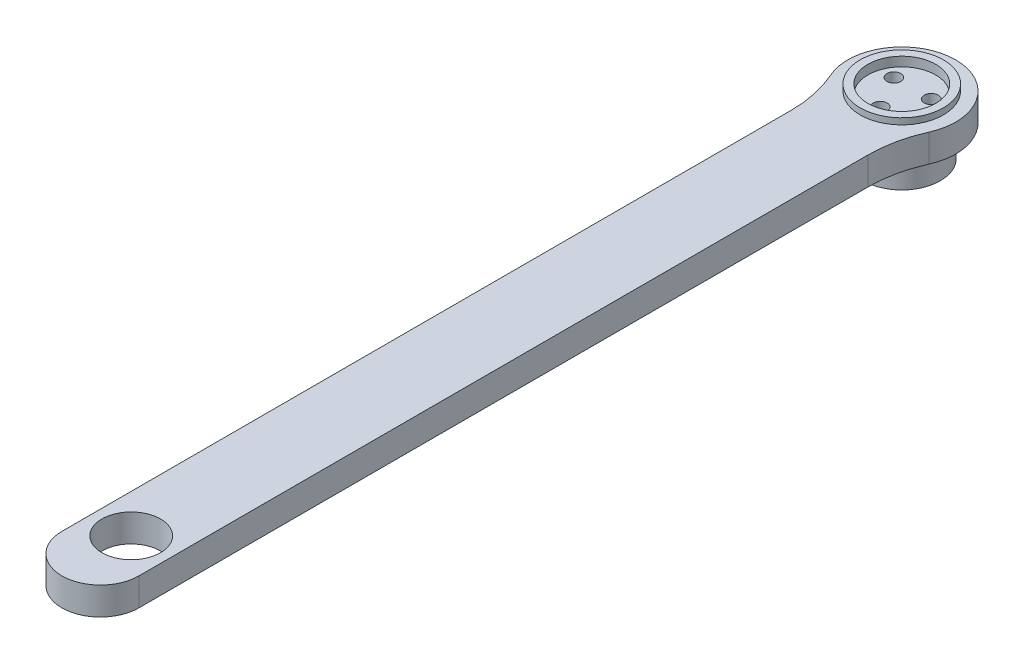
ISO-10303-21;
HEADER;
FILE_DESCRIPTION(('STEP AP214'),'2;1');
FILE_NAME('part.step','',(''),(''),'','','');
FILE_SCHEMA(('AUTOMOTIVE_DESIGN { 1 0 10303 214 1 1 1 1 }'));
ENDSEC;
DATA;
#1=APPLICATION_CONTEXT('core data for automotive mechanical design processes');
#2=APPLICATION_PROTOCOL_DEFINITION('international standard','automotive_design',2000,#1);
#3=PRODUCT_CONTEXT('',#1,'mechanical');
#4=PRODUCT('Part','Part','',(#3));
#5=PRODUCT_RELATED_PRODUCT_CATEGORY('part','',(#4));
#6=PRODUCT_DEFINITION_FORMATION('','',#4);
#7=PRODUCT_DEFINITION_CONTEXT('part definition',#1,'design');
#8=PRODUCT_DEFINITION('design','',#6,#7);
#9=PRODUCT_DEFINITION_SHAPE('','',#8);
#10=(LENGTH_UNIT() NAMED_UNIT(*) SI_UNIT(.MILLI.,.METRE.));
#11=(NAMED_UNIT(*) PLANE_ANGLE_UNIT() SI_UNIT($,.RADIAN.));
#12=(NAMED_UNIT(*) SI_UNIT($,.STERADIAN.) SOLID_ANGLE_UNIT());
#13=UNCERTAINTY_MEASURE_WITH_UNIT(LENGTH_MEASURE(1.E-05),#10,'distance_accuracy_value','');
#14=(GEOMETRIC_REPRESENTATION_CONTEXT(3) GLOBAL_UNCERTAINTY_ASSIGNED_CONTEXT((#13)) GLOBAL_UNIT_ASSIGNED_CONTEXT((#10,
#11,#12)) REPRESENTATION_CONTEXT('',''));
#15=CARTESIAN_POINT('',(0.,0.,0.));
#16=DIRECTION('',(0.,0.,1.));
#17=DIRECTION('',(1.,0.,0.));
#18=AXIS2_PLACEMENT_3D('',#15,#16,#17);
#19=CARTESIAN_POINT('',(0.,-3.,7.));
#20=DIRECTION('',(0.,-1.,0.));
#21=DIRECTION('',(0.,0.,-1.));
#22=AXIS2_PLACEMENT_3D('',#19,#20,#21);
#23=CYLINDRICAL_SURFACE('',#22,2.25);
#24=CARTESIAN_POINT('',(0.,1.4,7.));
#25=DIRECTION('',(0.,-1.,0.));
#26=DIRECTION('',(0.,0.,-1.));
#27=AXIS2_PLACEMENT_3D('',#24,#25,#26);
#28=CIRCLE('',#27,2.25000000000001);
#29=CARTESIAN_POINT('',(0.,1.4,4.74999999999999));
#30=VERTEX_POINT('',#29);
#31=EDGE_CURVE('E468',#30,#30,#28,.T.);
#32=ORIENTED_EDGE('',*,*,#31,.T.);
#33=EDGE_LOOP('',(#32));
#34=FACE_BOUND('',#33,.T.);
#35=CARTESIAN_POINT('',(0.,8.,7.));
#36=DIRECTION('',(0.,1.,0.));
#37=DIRECTION('',(0.,0.,1.));
#38=AXIS2_PLACEMENT_3D('',#35,#36,#37);
#39=CIRCLE('',#38,2.25);
#40=CARTESIAN_POINT('',(0.,8.,9.25000000000001));
#41=VERTEX_POINT('',#40);
#42=EDGE_CURVE('E435',#41,#41,#39,.F.);
#43=ORIENTED_EDGE('',*,*,#42,.F.);
#44=EDGE_LOOP('',(#43));
#45=FACE_BOUND('',#44,.T.);
#46=ADVANCED_FACE('F38',(#34,#45),#23,.F.);
#47=CARTESIAN_POINT('',(-6.06217782649106,-3.,-3.50000000000003));
#48=DIRECTION('',(0.,-1.,0.));
#49=DIRECTION('',(0.,0.,-1.));
#50=AXIS2_PLACEMENT_3D('',#47,#48,#49);
#51=CYLINDRICAL_SURFACE('',#50,2.25);
#52=CARTESIAN_POINT('',(-6.06217782649106,1.4,-3.50000000000003));
#53=DIRECTION('',(0.,-1.,0.));
#54=DIRECTION('',(0.,0.,-1.));
#55=AXIS2_PLACEMENT_3D('',#52,#53,#54);
#56=CIRCLE('',#55,2.25000000000001);
#57=CARTESIAN_POINT('',(-6.06217782649106,1.4,-5.75000000000004));
#58=VERTEX_POINT('',#57);
#59=EDGE_CURVE('E462',#58,#58,#56,.T.);
#60=ORIENTED_EDGE('',*,*,#59,.T.);
#61=EDGE_LOOP('',(#60));
#62=FACE_BOUND('',#61,.T.);
#63=CARTESIAN_POINT('',(-6.06217782649106,8.,-3.50000000000003));
#64=DIRECTION('',(0.,1.,0.));
#65=DIRECTION('',(0.,0.,1.));
#66=AXIS2_PLACEMENT_3D('',#63,#64,#65);
#67=CIRCLE('',#66,2.25);
#68=CARTESIAN_POINT('',(-6.06217782649106,8.,-1.25000000000002));
#69=VERTEX_POINT('',#68);
#70=EDGE_CURVE('E134',#69,#69,#67,.F.);
#71=ORIENTED_EDGE('',*,*,#70,.F.);
#72=EDGE_LOOP('',(#71));
#73=FACE_BOUND('',#72,.T.);
#74=ADVANCED_FACE('F164',(#62,#73),#51,.F.);
#75=CARTESIAN_POINT('',(6.0621778264911,-3.,-3.49999999999994));
#76=DIRECTION('',(0.,-1.,0.));
#77=DIRECTION('',(0.,0.,-1.));
#78=AXIS2_PLACEMENT_3D('',#75,#76,#77);
#79=CYLINDRICAL_SURFACE('',#78,2.25);
#80=CARTESIAN_POINT('',(6.0621778264911,1.4,-3.49999999999994));
#81=DIRECTION('',(0.,-1.,0.));
#82=DIRECTION('',(0.,0.,-1.));
#83=AXIS2_PLACEMENT_3D('',#80,#81,#82);
#84=CIRCLE('',#83,2.25000000000001);
#85=CARTESIAN_POINT('',(6.0621778264911,1.4,-5.74999999999996));
#86=VERTEX_POINT('',#85);
#87=EDGE_CURVE('E426',#86,#86,#84,.T.);
#88=ORIENTED_EDGE('',*,*,#87,.T.);
#89=EDGE_LOOP('',(#88));
#90=FACE_BOUND('',#89,.T.);
#91=CARTESIAN_POINT('',(6.0621778264911,8.,-3.49999999999994));
#92=DIRECTION('',(0.,1.,0.));
#93=DIRECTION('',(0.,0.,1.));
#94=AXIS2_PLACEMENT_3D('',#91,#92,#93);
#95=CIRCLE('',#94,2.25);
#96=CARTESIAN_POINT('',(6.0621778264911,8.,-1.24999999999994));
#97=VERTEX_POINT('',#96);
#98=EDGE_CURVE('E131',#97,#97,#95,.F.);
#99=ORIENTED_EDGE('',*,*,#98,.F.);
#100=EDGE_LOOP('',(#99));
#101=FACE_BOUND('',#100,.T.);
#102=ADVANCED_FACE('F170',(#90,#101),#79,.F.);
#103=CARTESIAN_POINT('',(0.,11.,0.));
#104=DIRECTION('',(0.,1.,0.));
#105=DIRECTION('',(0.,0.,1.));
#106=AXIS2_PLACEMENT_3D('',#103,#104,#105);
#107=PLANE('',#106);
#108=CARTESIAN_POINT('',(0.,11.,0.));
#109=DIRECTION('',(0.,1.,0.));
#110=DIRECTION('',(0.,0.,1.));
#111=AXIS2_PLACEMENT_3D('',#108,#109,#110);
#112=CIRCLE('',#111,11.);
#113=CARTESIAN_POINT('',(0.,11.,11.));
#114=VERTEX_POINT('',#113);
#115=EDGE_CURVE('E516',#114,#114,#112,.T.);
#116=ORIENTED_EDGE('',*,*,#115,.F.);
#117=EDGE_LOOP('',(#116));
#118=FACE_BOUND('',#117,.T.);
#119=CARTESIAN_POINT('',(0.,11.,0.));
#120=DIRECTION('',(0.,1.,0.));
#121=DIRECTION('',(0.,0.,1.));
#122=AXIS2_PLACEMENT_3D('',#119,#120,#121);
#123=CIRCLE('',#122,13.5);
#124=CARTESIAN_POINT('',(0.,11.,13.5));
#125=VERTEX_POINT('',#124);
#126=EDGE_CURVE('E118',#125,#125,#123,.T.);
#127=ORIENTED_EDGE('',*,*,#126,.T.);
#128=EDGE_LOOP('',(#127));
#129=FACE_BOUND('',#128,.T.);
#130=ADVANCED_FACE('F192',(#118,#129),#107,.T.);
#131=CARTESIAN_POINT('',(0.,9.,0.));
#132=DIRECTION('',(0.,-1.,0.));
#133=DIRECTION('',(0.,0.,-1.));
#134=AXIS2_PLACEMENT_3D('',#131,#132,#133);
#135=CYLINDRICAL_SURFACE('',#134,17.5);
#136=CARTESIAN_POINT('',(0.,9.,0.));
#137=DIRECTION('',(0.,1.,0.));
#138=DIRECTION('',(0.,0.,1.));
#139=AXIS2_PLACEMENT_3D('',#136,#137,#138);
#140=CIRCLE('',#139,17.5);
#141=CARTESIAN_POINT('',(15.9782608695652,9.,7.1375891997313));
#142=VERTEX_POINT('',#141);
#143=CARTESIAN_POINT('',(-15.9782608695652,9.,7.1375891997313));
#144=VERTEX_POINT('',#143);
#145=EDGE_CURVE('E95',#142,#144,#140,.T.);
#146=ORIENTED_EDGE('',*,*,#145,.F.);
#147=DIRECTION('',(0.,-1.,0.));
#148=VECTOR('',#147,1.);
#149=CARTESIAN_POINT('',(15.9782608695652,9.,7.1375891997313));
#150=LINE('',#149,#148);
#151=CARTESIAN_POINT('',(15.9782608695652,0.,7.1375891997313));
#152=VERTEX_POINT('',#151);
#153=EDGE_CURVE('E138',#142,#152,#150,.T.);
#154=ORIENTED_EDGE('',*,*,#153,.T.);
#155=CARTESIAN_POINT('',(0.,0.,0.));
#156=DIRECTION('',(0.,1.,0.));
#157=DIRECTION('',(0.,0.,1.));
#158=AXIS2_PLACEMENT_3D('',#155,#156,#157);
#159=CIRCLE('',#158,17.5);
#160=CARTESIAN_POINT('',(-15.9782608695652,0.,7.1375891997313));
#161=VERTEX_POINT('',#160);
#162=EDGE_CURVE('E115',#152,#161,#159,.T.);
#163=ORIENTED_EDGE('',*,*,#162,.T.);
#164=DIRECTION('',(0.,-1.,0.));
#165=VECTOR('',#164,1.);
#166=CARTESIAN_POINT('',(-15.9782608695652,9.,7.1375891997313));
#167=LINE('',#166,#165);
#168=EDGE_CURVE('E136',#161,#144,#167,.F.);
#169=ORIENTED_EDGE('',*,*,#168,.T.);
#170=EDGE_LOOP('',(#146,#154,#163,#169));
#171=FACE_BOUND('',#170,.T.);
#172=ADVANCED_FACE('F154',(#171),#135,.T.);
#173=CARTESIAN_POINT('',(-12.5,9.,260.));
#174=DIRECTION('',(1.,0.,0.));
#175=DIRECTION('',(0.,0.,-1.));
#176=AXIS2_PLACEMENT_3D('',#173,#174,#175);
#177=PLANE('',#176);
#178=DIRECTION('',(0.,0.,1.));
#179=VECTOR('',#178,1.);
#180=CARTESIAN_POINT('',(-12.5,9.,260.));
#181=LINE('',#180,#179);
#182=CARTESIAN_POINT('',(-12.5,9.,23.4520787991171));
#183=VERTEX_POINT('',#182);
#184=CARTESIAN_POINT('',(-12.4999999999999,9.,260.));
#185=VERTEX_POINT('',#184);
#186=EDGE_CURVE('E87',#183,#185,#181,.T.);
#187=ORIENTED_EDGE('',*,*,#186,.F.);
#188=DIRECTION('',(0.,1.,0.));
#189=VECTOR('',#188,1.);
#190=CARTESIAN_POINT('',(-12.5,0.,23.4520787991171));
#191=LINE('',#190,#189);
#192=CARTESIAN_POINT('',(-12.5,0.,23.4520787991171));
#193=VERTEX_POINT('',#192);
#194=EDGE_CURVE('E144',#183,#193,#191,.F.);
#195=ORIENTED_EDGE('',*,*,#194,.T.);
#196=DIRECTION('',(0.,0.,1.));
#197=VECTOR('',#196,1.);
#198=CARTESIAN_POINT('',(-12.5,0.,260.));
#199=LINE('',#198,#197);
#200=CARTESIAN_POINT('',(-12.4999999999999,0.,260.));
#201=VERTEX_POINT('',#200);
#202=EDGE_CURVE('E101',#193,#201,#199,.T.);
#203=ORIENTED_EDGE('',*,*,#202,.T.);
#204=DIRECTION('',(0.,-1.,0.));
#205=VECTOR('',#204,1.);
#206=CARTESIAN_POINT('',(-12.4999999999999,9.,260.));
#207=LINE('',#206,#205);
#208=EDGE_CURVE('E98',#185,#201,#207,.T.);
#209=ORIENTED_EDGE('',*,*,#208,.F.);
#210=EDGE_LOOP('',(#187,#195,#203,#209));
#211=FACE_BOUND('',#210,.T.);
#212=ADVANCED_FACE('F99',(#211),#177,.F.);
#213=CARTESIAN_POINT('',(0.,9.,260.));
#214=DIRECTION('',(0.,-1.,0.));
#215=DIRECTION('',(0.,0.,-1.));
#216=AXIS2_PLACEMENT_3D('',#213,#214,#215);
#217=CYLINDRICAL_SURFACE('',#216,12.5);
#218=CARTESIAN_POINT('',(0.,0.,260.));
#219=DIRECTION('',(0.,1.,0.));
#220=DIRECTION('',(0.,0.,1.));
#221=AXIS2_PLACEMENT_3D('',#218,#219,#220);
#222=CIRCLE('',#221,12.5);
#223=CARTESIAN_POINT('',(12.5,0.,260.));
#224=VERTEX_POINT('',#223);
#225=EDGE_CURVE('E120',#201,#224,#222,.T.);
#226=ORIENTED_EDGE('',*,*,#225,.T.);
#227=DIRECTION('',(0.,-1.,0.));
#228=VECTOR('',#227,1.);
#229=CARTESIAN_POINT('',(12.5,9.,260.));
#230=LINE('',#229,#228);
#231=CARTESIAN_POINT('',(12.5,9.,260.));
#232=VERTEX_POINT('',#231);
#233=EDGE_CURVE('E105',#232,#224,#230,.T.);
#234=ORIENTED_EDGE('',*,*,#233,.F.);
#235=CARTESIAN_POINT('',(0.,9.,260.));
#236=DIRECTION('',(0.,1.,0.));
#237=DIRECTION('',(0.,0.,1.));
#238=AXIS2_PLACEMENT_3D('',#235,#236,#237);
#239=CIRCLE('',#238,12.5);
#240=EDGE_CURVE('E92',#185,#232,#239,.T.);
#241=ORIENTED_EDGE('',*,*,#240,.F.);
#242=ORIENTED_EDGE('',*,*,#208,.T.);
#243=EDGE_LOOP('',(#226,#234,#241,#242));
#244=FACE_BOUND('',#243,.T.);
#245=ADVANCED_FACE('F107',(#244),#217,.T.);
#246=CARTESIAN_POINT('',(12.5,9.,260.));
#247=DIRECTION('',(-1.,0.,0.));
#248=DIRECTION('',(0.,0.,1.));
#249=AXIS2_PLACEMENT_3D('',#246,#247,#248);
#250=PLANE('',#249);
#251=DIRECTION('',(0.,0.,-1.));
#252=VECTOR('',#251,1.);
#253=CARTESIAN_POINT('',(12.5,0.,260.));
#254=LINE('',#253,#252);
#255=CARTESIAN_POINT('',(12.5,0.,23.4520787991171));
#256=VERTEX_POINT('',#255);
#257=EDGE_CURVE('E122',#224,#256,#254,.T.);
#258=ORIENTED_EDGE('',*,*,#257,.T.);
#259=DIRECTION('',(0.,1.,0.));
#260=VECTOR('',#259,1.);
#261=CARTESIAN_POINT('',(12.5,9.,23.4520787991171));
#262=LINE('',#261,#260);
#263=CARTESIAN_POINT('',(12.5,9.,23.4520787991171));
#264=VERTEX_POINT('',#263);
#265=EDGE_CURVE('E142',#256,#264,#262,.T.);
#266=ORIENTED_EDGE('',*,*,#265,.T.);
#267=DIRECTION('',(0.,0.,-1.));
#268=VECTOR('',#267,1.);
#269=CARTESIAN_POINT('',(12.5,9.,260.));
#270=LINE('',#269,#268);
#271=EDGE_CURVE('E110',#232,#264,#270,.T.);
#272=ORIENTED_EDGE('',*,*,#271,.F.);
#273=ORIENTED_EDGE('',*,*,#233,.T.);
#274=EDGE_LOOP('',(#258,#266,#272,#273));
#275=FACE_BOUND('',#274,.T.);
#276=ADVANCED_FACE('F201',(#275),#250,.F.);
#277=CARTESIAN_POINT('',(0.,9.,0.));
#278=DIRECTION('',(0.,1.,0.));
#279=DIRECTION('',(0.,0.,1.));
#280=AXIS2_PLACEMENT_3D('',#277,#278,#279);
#281=PLANE('',#280);
#282=CARTESIAN_POINT('',(0.,9.,250.));
#283=DIRECTION('',(0.,1.,0.));
#284=DIRECTION('',(0.,0.,1.));
#285=AXIS2_PLACEMENT_3D('',#282,#283,#284);
#286=CIRCLE('',#285,9.50000000000001);
#287=CARTESIAN_POINT('',(0.,9.,259.5));
#288=VERTEX_POINT('',#287);
#289=EDGE_CURVE('E130',#288,#288,#286,.T.);
#290=ORIENTED_EDGE('',*,*,#289,.F.);
#291=EDGE_LOOP('',(#290));
#292=FACE_BOUND('',#291,.T.);
#293=CARTESIAN_POINT('',(0.,9.,0.));
#294=DIRECTION('',(0.,1.,0.));
#295=DIRECTION('',(0.,0.,1.));
#296=AXIS2_PLACEMENT_3D('',#293,#294,#295);
#297=CIRCLE('',#296,13.5);
#298=CARTESIAN_POINT('',(0.,9.,13.5));
#299=VERTEX_POINT('',#298);
#300=EDGE_CURVE('E104',#299,#299,#297,.T.);
#301=ORIENTED_EDGE('',*,*,#300,.F.);
#302=EDGE_LOOP('',(#301));
#303=FACE_BOUND('',#302,.T.);
#304=ORIENTED_EDGE('',*,*,#271,.T.);
#305=CARTESIAN_POINT('',(52.5,9.,23.4520787991171));
#306=DIRECTION('',(0.,1.,0.));
#307=DIRECTION('',(0.,0.,1.));
#308=AXIS2_PLACEMENT_3D('',#305,#306,#307);
#309=CIRCLE('',#308,40.);
#310=EDGE_CURVE('E148',#264,#142,#309,.F.);
#311=ORIENTED_EDGE('',*,*,#310,.T.);
#312=ORIENTED_EDGE('',*,*,#145,.T.);
#313=CARTESIAN_POINT('',(-52.5,9.,23.4520787991171));
#314=DIRECTION('',(0.,1.,0.));
#315=DIRECTION('',(0.,0.,1.));
#316=AXIS2_PLACEMENT_3D('',#313,#314,#315);
#317=CIRCLE('',#316,40.);
#318=EDGE_CURVE('E11',#144,#183,#317,.F.);
#319=ORIENTED_EDGE('',*,*,#318,.T.);
#320=ORIENTED_EDGE('',*,*,#186,.T.);
#321=ORIENTED_EDGE('',*,*,#240,.T.);
#322=EDGE_LOOP('',(#304,#311,#312,#319,#320,#321));
#323=FACE_BOUND('',#322,.T.);
#324=ADVANCED_FACE('F90',(#292,#303,#323),#281,.T.);
#325=CARTESIAN_POINT('',(0.,0.,0.));
#326=DIRECTION('',(0.,1.,0.));
#327=DIRECTION('',(0.,0.,1.));
#328=AXIS2_PLACEMENT_3D('',#325,#326,#327);
#329=PLANE('',#328);
#330=CARTESIAN_POINT('',(0.,0.,250.));
#331=DIRECTION('',(0.,1.,0.));
#332=DIRECTION('',(0.,0.,1.));
#333=AXIS2_PLACEMENT_3D('',#330,#331,#332);
#334=CIRCLE('',#333,9.50000000000001);
#335=CARTESIAN_POINT('',(0.,0.,259.5));
#336=VERTEX_POINT('',#335);
#337=EDGE_CURVE('E126',#336,#336,#334,.T.);
#338=ORIENTED_EDGE('',*,*,#337,.T.);
#339=EDGE_LOOP('',(#338));
#340=FACE_BOUND('',#339,.T.);
#341=CARTESIAN_POINT('',(0.,0.,0.));
#342=DIRECTION('',(0.,-1.,0.));
#343=DIRECTION('',(0.,0.,-1.));
#344=AXIS2_PLACEMENT_3D('',#341,#342,#343);
#345=CIRCLE('',#344,13.5);
#346=CARTESIAN_POINT('',(0.,0.,-13.5));
#347=VERTEX_POINT('',#346);
#348=EDGE_CURVE('E455',#347,#347,#345,.T.);
#349=ORIENTED_EDGE('',*,*,#348,.F.);
#350=EDGE_LOOP('',(#349));
#351=FACE_BOUND('',#350,.T.);
#352=ORIENTED_EDGE('',*,*,#162,.F.);
#353=CARTESIAN_POINT('',(52.5,0.,23.4520787991171));
#354=DIRECTION('',(0.,1.,0.));
#355=DIRECTION('',(0.,0.,1.));
#356=AXIS2_PLACEMENT_3D('',#353,#354,#355);
#357=CIRCLE('',#356,40.);
#358=EDGE_CURVE('E146',#152,#256,#357,.T.);
#359=ORIENTED_EDGE('',*,*,#358,.T.);
#360=ORIENTED_EDGE('',*,*,#257,.F.);
#361=ORIENTED_EDGE('',*,*,#225,.F.);
#362=ORIENTED_EDGE('',*,*,#202,.F.);
#363=CARTESIAN_POINT('',(-52.5,0.,23.4520787991171));
#364=DIRECTION('',(0.,1.,0.));
#365=DIRECTION('',(0.,0.,1.));
#366=AXIS2_PLACEMENT_3D('',#363,#364,#365);
#367=CIRCLE('',#366,40.);
#368=EDGE_CURVE('E46',#193,#161,#367,.T.);
#369=ORIENTED_EDGE('',*,*,#368,.T.);
#370=EDGE_LOOP('',(#352,#359,#360,#361,#362,#369));
#371=FACE_BOUND('',#370,.T.);
#372=ADVANCED_FACE('F151',(#340,#351,#371),#329,.F.);
#373=CARTESIAN_POINT('',(0.,11.,0.));
#374=DIRECTION('',(0.,-1.,0.));
#375=DIRECTION('',(0.,0.,-1.));
#376=AXIS2_PLACEMENT_3D('',#373,#374,#375);
#377=CYLINDRICAL_SURFACE('',#376,13.5);
#378=ORIENTED_EDGE('',*,*,#126,.F.);
#379=EDGE_LOOP('',(#378));
#380=FACE_BOUND('',#379,.T.);
#381=ORIENTED_EDGE('',*,*,#300,.T.);
#382=EDGE_LOOP('',(#381));
#383=FACE_BOUND('',#382,.T.);
#384=ADVANCED_FACE('F190',(#380,#383),#377,.T.);
#385=CARTESIAN_POINT('',(0.,-3.,0.));
#386=DIRECTION('',(0.,1.,0.));
#387=DIRECTION('',(0.,0.,1.));
#388=AXIS2_PLACEMENT_3D('',#385,#386,#387);
#389=CYLINDRICAL_SURFACE('',#388,13.5);
#390=CARTESIAN_POINT('',(0.,-3.,0.));
#391=DIRECTION('',(0.,-1.,0.));
#392=DIRECTION('',(0.,0.,-1.));
#393=AXIS2_PLACEMENT_3D('',#390,#391,#392);
#394=CIRCLE('',#393,13.5);
#395=CARTESIAN_POINT('',(0.,-3.,-13.5));
#396=VERTEX_POINT('',#395);
#397=EDGE_CURVE('E129',#396,#396,#394,.T.);
#398=ORIENTED_EDGE('',*,*,#397,.F.);
#399=EDGE_LOOP('',(#398));
#400=FACE_BOUND('',#399,.T.);
#401=ORIENTED_EDGE('',*,*,#348,.T.);
#402=EDGE_LOOP('',(#401));
#403=FACE_BOUND('',#402,.T.);
#404=ADVANCED_FACE('F186',(#400,#403),#389,.T.);
#405=CARTESIAN_POINT('',(0.,-3.,0.));
#406=DIRECTION('',(0.,-1.,0.));
#407=DIRECTION('',(0.,0.,-1.));
#408=AXIS2_PLACEMENT_3D('',#405,#406,#407);
#409=PLANE('',#408);
#410=CARTESIAN_POINT('',(0.,-3.,0.));
#411=DIRECTION('',(0.,-1.,0.));
#412=DIRECTION('',(0.,0.,-1.));
#413=AXIS2_PLACEMENT_3D('',#410,#411,#412);
#414=CIRCLE('',#413,12.5);
#415=CARTESIAN_POINT('',(0.,-3.,-12.5));
#416=VERTEX_POINT('',#415);
#417=EDGE_CURVE('E139',#416,#416,#414,.T.);
#418=ORIENTED_EDGE('',*,*,#417,.F.);
#419=EDGE_LOOP('',(#418));
#420=FACE_BOUND('',#419,.T.);
#421=ORIENTED_EDGE('',*,*,#397,.T.);
#422=EDGE_LOOP('',(#421));
#423=FACE_BOUND('',#422,.T.);
#424=ADVANCED_FACE('F182',(#420,#423),#409,.T.);
#425=CARTESIAN_POINT('',(0.,-3.,250.));
#426=DIRECTION('',(0.,1.,0.));
#427=DIRECTION('',(0.,0.,1.));
#428=AXIS2_PLACEMENT_3D('',#425,#426,#427);
#429=CYLINDRICAL_SURFACE('',#428,9.50000000000001);
#430=ORIENTED_EDGE('',*,*,#289,.T.);
#431=EDGE_LOOP('',(#430));
#432=FACE_BOUND('',#431,.T.);
#433=ORIENTED_EDGE('',*,*,#337,.F.);
#434=EDGE_LOOP('',(#433));
#435=FACE_BOUND('',#434,.T.);
#436=ADVANCED_FACE('F179',(#432,#435),#429,.F.);
#437=CARTESIAN_POINT('',(2.25000000000001,1.4,7.));
#438=DIRECTION('',(0.,1.,0.));
#439=DIRECTION('',(0.,0.,1.));
#440=AXIS2_PLACEMENT_3D('',#437,#438,#439);
#441=PLANE('',#440);
#442=ORIENTED_EDGE('',*,*,#31,.F.);
#443=EDGE_LOOP('',(#442));
#444=FACE_BOUND('',#443,.T.);
#445=CARTESIAN_POINT('',(0.,1.4,7.));
#446=DIRECTION('',(0.,-1.,0.));
#447=DIRECTION('',(0.,0.,-1.));
#448=AXIS2_PLACEMENT_3D('',#445,#446,#447);
#449=CIRCLE('',#448,3.99999999999999);
#450=CARTESIAN_POINT('',(0.,1.4,3.00000000000001));
#451=VERTEX_POINT('',#450);
#452=EDGE_CURVE('E465',#451,#451,#449,.T.);
#453=ORIENTED_EDGE('',*,*,#452,.T.);
#454=EDGE_LOOP('',(#453));
#455=FACE_BOUND('',#454,.T.);
#456=ADVANCED_FACE('F177',(#444,#455),#441,.F.);
#457=CARTESIAN_POINT('',(0.,-3.,7.));
#458=DIRECTION('',(0.,-1.,0.));
#459=DIRECTION('',(0.,0.,-1.));
#460=AXIS2_PLACEMENT_3D('',#457,#458,#459);
#461=CYLINDRICAL_SURFACE('',#460,3.99999999999999);
#462=ORIENTED_EDGE('',*,*,#452,.F.);
#463=EDGE_LOOP('',(#462));
#464=FACE_BOUND('',#463,.T.);
#465=CARTESIAN_POINT('',(0.,-10.,7.));
#466=DIRECTION('',(0.,-1.,0.));
#467=DIRECTION('',(0.,0.,-1.));
#468=AXIS2_PLACEMENT_3D('',#465,#466,#467);
#469=CIRCLE('',#468,3.99999999999999);
#470=CARTESIAN_POINT('',(0.,-10.,3.00000000000001));
#471=VERTEX_POINT('',#470);
#472=EDGE_CURVE('E439',#471,#471,#469,.F.);
#473=ORIENTED_EDGE('',*,*,#472,.F.);
#474=EDGE_LOOP('',(#473));
#475=FACE_BOUND('',#474,.T.);
#476=ADVANCED_FACE('F265',(#464,#475),#461,.F.);
#477=CARTESIAN_POINT('',(-3.81217782649104,1.4,-3.50000000000003));
#478=DIRECTION('',(0.,1.,0.));
#479=DIRECTION('',(0.,0.,1.));
#480=AXIS2_PLACEMENT_3D('',#477,#478,#479);
#481=PLANE('',#480);
#482=ORIENTED_EDGE('',*,*,#59,.F.);
#483=EDGE_LOOP('',(#482));
#484=FACE_BOUND('',#483,.T.);
#485=CARTESIAN_POINT('',(-6.06217782649106,1.4,-3.50000000000003));
#486=DIRECTION('',(0.,-1.,0.));
#487=DIRECTION('',(0.,0.,-1.));
#488=AXIS2_PLACEMENT_3D('',#485,#486,#487);
#489=CIRCLE('',#488,3.99999999999999);
#490=CARTESIAN_POINT('',(-6.06217782649106,1.4,-7.50000000000002));
#491=VERTEX_POINT('',#490);
#492=EDGE_CURVE('E459',#491,#491,#489,.T.);
#493=ORIENTED_EDGE('',*,*,#492,.T.);
#494=EDGE_LOOP('',(#493));
#495=FACE_BOUND('',#494,.T.);
#496=ADVANCED_FACE('F272',(#484,#495),#481,.F.);
#497=CARTESIAN_POINT('',(-6.06217782649106,-3.,-3.50000000000003));
#498=DIRECTION('',(0.,-1.,0.));
#499=DIRECTION('',(0.,0.,-1.));
#500=AXIS2_PLACEMENT_3D('',#497,#498,#499);
#501=CYLINDRICAL_SURFACE('',#500,3.99999999999999);
#502=ORIENTED_EDGE('',*,*,#492,.F.);
#503=EDGE_LOOP('',(#502));
#504=FACE_BOUND('',#503,.T.);
#505=CARTESIAN_POINT('',(-6.06217782649106,-10.,-3.50000000000003));
#506=DIRECTION('',(0.,-1.,0.));
#507=DIRECTION('',(0.,0.,-1.));
#508=AXIS2_PLACEMENT_3D('',#505,#506,#507);
#509=CIRCLE('',#508,3.99999999999999);
#510=CARTESIAN_POINT('',(-6.06217782649106,-10.,-7.50000000000002));
#511=VERTEX_POINT('',#510);
#512=EDGE_CURVE('E446',#511,#511,#509,.F.);
#513=ORIENTED_EDGE('',*,*,#512,.F.);
#514=EDGE_LOOP('',(#513));
#515=FACE_BOUND('',#514,.T.);
#516=ADVANCED_FACE('F279',(#504,#515),#501,.F.);
#517=CARTESIAN_POINT('',(8.31217782649112,1.4,-3.49999999999994));
#518=DIRECTION('',(0.,1.,0.));
#519=DIRECTION('',(0.,0.,1.));
#520=AXIS2_PLACEMENT_3D('',#517,#518,#519);
#521=PLANE('',#520);
#522=ORIENTED_EDGE('',*,*,#87,.F.);
#523=EDGE_LOOP('',(#522));
#524=FACE_BOUND('',#523,.T.);
#525=CARTESIAN_POINT('',(6.0621778264911,1.4,-3.49999999999994));
#526=DIRECTION('',(0.,-1.,0.));
#527=DIRECTION('',(0.,0.,-1.));
#528=AXIS2_PLACEMENT_3D('',#525,#526,#527);
#529=CIRCLE('',#528,3.99999999999999);
#530=CARTESIAN_POINT('',(6.0621778264911,1.4,-7.49999999999994));
#531=VERTEX_POINT('',#530);
#532=EDGE_CURVE('E452',#531,#531,#529,.T.);
#533=ORIENTED_EDGE('',*,*,#532,.T.);
#534=EDGE_LOOP('',(#533));
#535=FACE_BOUND('',#534,.T.);
#536=ADVANCED_FACE('F286',(#524,#535),#521,.F.);
#537=CARTESIAN_POINT('',(6.0621778264911,-3.,-3.49999999999994));
#538=DIRECTION('',(0.,-1.,0.));
#539=DIRECTION('',(0.,0.,-1.));
#540=AXIS2_PLACEMENT_3D('',#537,#538,#539);
#541=CYLINDRICAL_SURFACE('',#540,3.99999999999999);
#542=ORIENTED_EDGE('',*,*,#532,.F.);
#543=EDGE_LOOP('',(#542));
#544=FACE_BOUND('',#543,.T.);
#545=CARTESIAN_POINT('',(6.0621778264911,-10.,-3.49999999999994));
#546=DIRECTION('',(0.,-1.,0.));
#547=DIRECTION('',(0.,0.,-1.));
#548=AXIS2_PLACEMENT_3D('',#545,#546,#547);
#549=CIRCLE('',#548,3.99999999999999);
#550=CARTESIAN_POINT('',(6.0621778264911,-10.,-7.49999999999994));
#551=VERTEX_POINT('',#550);
#552=EDGE_CURVE('E436',#551,#551,#549,.F.);
#553=ORIENTED_EDGE('',*,*,#552,.F.);
#554=EDGE_LOOP('',(#553));
#555=FACE_BOUND('',#554,.T.);
#556=ADVANCED_FACE('F294',(#544,#555),#541,.F.);
#557=CARTESIAN_POINT('',(0.,-10.,0.));
#558=DIRECTION('',(0.,1.,0.));
#559=DIRECTION('',(0.,0.,1.));
#560=AXIS2_PLACEMENT_3D('',#557,#558,#559);
#561=CYLINDRICAL_SURFACE('',#560,12.5);
#562=CARTESIAN_POINT('',(0.,-10.,0.));
#563=DIRECTION('',(0.,-1.,0.));
#564=DIRECTION('',(0.,0.,-1.));
#565=AXIS2_PLACEMENT_3D('',#562,#563,#564);
#566=CIRCLE('',#565,12.5);
#567=CARTESIAN_POINT('',(0.,-10.,-12.5));
#568=VERTEX_POINT('',#567);
#569=EDGE_CURVE('E449',#568,#568,#566,.T.);
#570=ORIENTED_EDGE('',*,*,#569,.F.);
#571=EDGE_LOOP('',(#570));
#572=FACE_BOUND('',#571,.T.);
#573=ORIENTED_EDGE('',*,*,#417,.T.);
#574=EDGE_LOOP('',(#573));
#575=FACE_BOUND('',#574,.T.);
#576=ADVANCED_FACE('F301',(#572,#575),#561,.T.);
#577=CARTESIAN_POINT('',(0.,-10.,0.));
#578=DIRECTION('',(0.,-1.,0.));
#579=DIRECTION('',(0.,0.,-1.));
#580=AXIS2_PLACEMENT_3D('',#577,#578,#579);
#581=PLANE('',#580);
#582=ORIENTED_EDGE('',*,*,#552,.T.);
#583=EDGE_LOOP('',(#582));
#584=FACE_BOUND('',#583,.T.);
#585=ORIENTED_EDGE('',*,*,#472,.T.);
#586=EDGE_LOOP('',(#585));
#587=FACE_BOUND('',#586,.T.);
#588=ORIENTED_EDGE('',*,*,#512,.T.);
#589=EDGE_LOOP('',(#588));
#590=FACE_BOUND('',#589,.T.);
#591=ORIENTED_EDGE('',*,*,#569,.T.);
#592=EDGE_LOOP('',(#591));
#593=FACE_BOUND('',#592,.T.);
#594=ADVANCED_FACE('F309',(#584,#587,#590,#593),#581,.T.);
#595=CARTESIAN_POINT('',(0.,8.,0.));
#596=DIRECTION('',(0.,1.,0.));
#597=DIRECTION('',(0.,0.,1.));
#598=AXIS2_PLACEMENT_3D('',#595,#596,#597);
#599=PLANE('',#598);
#600=CARTESIAN_POINT('',(0.,8.,0.));
#601=DIRECTION('',(0.,1.,0.));
#602=DIRECTION('',(0.,0.,1.));
#603=AXIS2_PLACEMENT_3D('',#600,#601,#602);
#604=CIRCLE('',#603,11.);
#605=CARTESIAN_POINT('',(0.,8.,11.));
#606=VERTEX_POINT('',#605);
#607=EDGE_CURVE('E135',#606,#606,#604,.T.);
#608=ORIENTED_EDGE('',*,*,#607,.T.);
#609=EDGE_LOOP('',(#608));
#610=FACE_BOUND('',#609,.T.);
#611=ORIENTED_EDGE('',*,*,#98,.T.);
#612=EDGE_LOOP('',(#611));
#613=FACE_BOUND('',#612,.T.);
#614=ORIENTED_EDGE('',*,*,#70,.T.);
#615=EDGE_LOOP('',(#614));
#616=FACE_BOUND('',#615,.T.);
#617=ORIENTED_EDGE('',*,*,#42,.T.);
#618=EDGE_LOOP('',(#617));
#619=FACE_BOUND('',#618,.T.);
#620=ADVANCED_FACE('F317',(#610,#613,#616,#619),#599,.T.);
#621=CARTESIAN_POINT('',(0.,8.,0.));
#622=DIRECTION('',(0.,1.,0.));
#623=DIRECTION('',(0.,0.,1.));
#624=AXIS2_PLACEMENT_3D('',#621,#622,#623);
#625=CYLINDRICAL_SURFACE('',#624,11.);
#626=ORIENTED_EDGE('',*,*,#607,.F.);
#627=EDGE_LOOP('',(#626));
#628=FACE_BOUND('',#627,.T.);
#629=ORIENTED_EDGE('',*,*,#115,.T.);
#630=EDGE_LOOP('',(#629));
#631=FACE_BOUND('',#630,.T.);
#632=ADVANCED_FACE('F161',(#628,#631),#625,.F.);
#633=CARTESIAN_POINT('',(52.5,9.,23.4520787991171));
#634=DIRECTION('',(0.,-1.,0.));
#635=DIRECTION('',(0.,0.,-1.));
#636=AXIS2_PLACEMENT_3D('',#633,#634,#635);
#637=CYLINDRICAL_SURFACE('',#636,40.);
#638=ORIENTED_EDGE('',*,*,#310,.F.);
#639=ORIENTED_EDGE('',*,*,#265,.F.);
#640=ORIENTED_EDGE('',*,*,#358,.F.);
#641=ORIENTED_EDGE('',*,*,#153,.F.);
#642=EDGE_LOOP('',(#638,#639,#640,#641));
#643=FACE_BOUND('',#642,.T.);
#644=ADVANCED_FACE('F157',(#643),#637,.F.);
#645=CARTESIAN_POINT('',(-52.5,9.,23.4520787991171));
#646=DIRECTION('',(0.,-1.,0.));
#647=DIRECTION('',(0.,0.,-1.));
#648=AXIS2_PLACEMENT_3D('',#645,#646,#647);
#649=CYLINDRICAL_SURFACE('',#648,40.);
#650=ORIENTED_EDGE('',*,*,#318,.F.);
#651=ORIENTED_EDGE('',*,*,#168,.F.);
#652=ORIENTED_EDGE('',*,*,#368,.F.);
#653=ORIENTED_EDGE('',*,*,#194,.F.);
#654=EDGE_LOOP('',(#650,#651,#652,#653));
#655=FACE_BOUND('',#654,.T.);
#656=ADVANCED_FACE('F40',(#655),#649,.F.);
#657=CLOSED_SHELL('',(#46,#74,#102,#130,#172,#212,#245,#276,#324,#372,#384,#404,#424,#436,#456,
#476,#496,#516,#536,#556,#576,#594,#620,#632,#644,#656));
#658=MANIFOLD_SOLID_BREP('B2',#657);
#659=ADVANCED_BREP_SHAPE_REPRESENTATION('',(#18,#658),#14);
#660=SHAPE_DEFINITION_REPRESENTATION(#9,#659);
ENDSEC;
END-ISO-10303-21;
